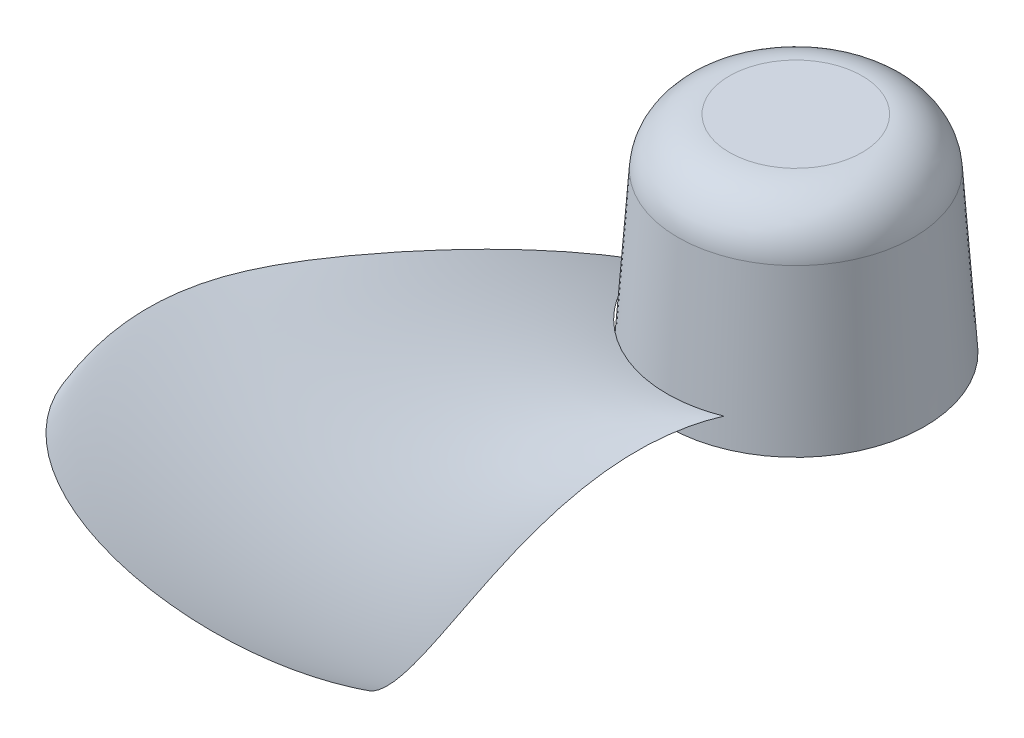
ISO-10303-21;
HEADER;
FILE_DESCRIPTION(('STEP AP214'),'2;1');
FILE_NAME('part.step','',(''),(''),'','','');
FILE_SCHEMA(('AUTOMOTIVE_DESIGN { 1 0 10303 214 1 1 1 1 }'));
ENDSEC;
DATA;
#1=APPLICATION_CONTEXT('core data for automotive mechanical design processes');
#2=APPLICATION_PROTOCOL_DEFINITION('international standard','automotive_design',2000,#1);
#3=PRODUCT_CONTEXT('',#1,'mechanical');
#4=PRODUCT('Part','Part','',(#3));
#5=PRODUCT_RELATED_PRODUCT_CATEGORY('part','',(#4));
#6=PRODUCT_DEFINITION_FORMATION('','',#4);
#7=PRODUCT_DEFINITION_CONTEXT('part definition',#1,'design');
#8=PRODUCT_DEFINITION('design','',#6,#7);
#9=PRODUCT_DEFINITION_SHAPE('','',#8);
#10=(LENGTH_UNIT() NAMED_UNIT(*) SI_UNIT(.MILLI.,.METRE.));
#11=(NAMED_UNIT(*) PLANE_ANGLE_UNIT() SI_UNIT($,.RADIAN.));
#12=(NAMED_UNIT(*) SI_UNIT($,.STERADIAN.) SOLID_ANGLE_UNIT());
#13=UNCERTAINTY_MEASURE_WITH_UNIT(LENGTH_MEASURE(1.E-05),#10,'distance_accuracy_value','');
#14=(GEOMETRIC_REPRESENTATION_CONTEXT(3) GLOBAL_UNCERTAINTY_ASSIGNED_CONTEXT((#13)) GLOBAL_UNIT_ASSIGNED_CONTEXT((#10,
#11,#12)) REPRESENTATION_CONTEXT('',''));
#15=CARTESIAN_POINT('',(0.,0.,0.));
#16=DIRECTION('',(0.,0.,1.));
#17=DIRECTION('',(1.,0.,0.));
#18=AXIS2_PLACEMENT_3D('',#15,#16,#17);
#19=CARTESIAN_POINT('',(-82.3339801079356,49.2189138139021,202.276709230073));
#20=CARTESIAN_POINT('',(-75.4971729120213,49.5652400510354,219.145027979575));
#21=CARTESIAN_POINT('',(-56.4769691664351,45.4608739233665,234.576873252754));
#22=CARTESIAN_POINT('',(-24.8536840963013,34.5970590210232,238.031380508595));
#23=CARTESIAN_POINT('',(7.18928574870839,21.4244877088076,230.945023223419));
#24=CARTESIAN_POINT('',(27.4685438189222,10.393852351522,214.754274873548));
#25=CARTESIAN_POINT('',(35.5644053394643,3.81390935903859,200.));
#26=CARTESIAN_POINT('',(-83.7414580789727,49.4749298561485,198.203067219453));
#27=CARTESIAN_POINT('',(-76.8274734725655,49.5213961036238,215.034421746334));
#28=CARTESIAN_POINT('',(-57.7864973817833,45.063570314038,230.587807898235));
#29=CARTESIAN_POINT('',(-26.1310399964921,33.8407951693911,234.443395282196));
#30=CARTESIAN_POINT('',(5.9944721920043,20.3573627067444,227.86961821542));
#31=CARTESIAN_POINT('',(26.4335057144552,9.11756496315893,212.157051141519));
#32=CARTESIAN_POINT('',(34.7334407745848,2.38205925663447,197.744592569006));
#33=CARTESIAN_POINT('',(-86.3743960144927,49.8297136167028,189.953410418889));
#34=CARTESIAN_POINT('',(-79.3347386509366,49.34227816669,206.697713101452));
#35=CARTESIAN_POINT('',(-60.2952409655178,44.2762604760124,222.474495912178));
#36=CARTESIAN_POINT('',(-28.6328030775855,32.4672014104149,227.105996754223));
#37=CARTESIAN_POINT('',(3.60042967021031,18.4936832105622,221.531133326088));
#38=CARTESIAN_POINT('',(24.3159910013801,6.93428811711902,206.755243705507));
#39=CARTESIAN_POINT('',(32.9953910768478,-0.0465247356594577,193.013294335989));
#40=CARTESIAN_POINT('',(-88.889625070759,49.8914685953709,179.483984585285));
#41=CARTESIAN_POINT('',(-81.7931735263499,48.8875698100463,196.081050277662));
#42=CARTESIAN_POINT('',(-62.9059689960096,43.2876829228264,212.07944563474));
#43=CARTESIAN_POINT('',(-31.4353990109419,31.047596529137,217.603993929814));
#44=CARTESIAN_POINT('',(0.731890904812313,16.7632987308732,213.200928180407));
#45=CARTESIAN_POINT('',(21.6426668485063,5.03077762993028,199.538252099295));
#46=CARTESIAN_POINT('',(30.6961014275635,-2.10575536911751,186.596017048733));
#47=CARTESIAN_POINT('',(-90.3170676782875,49.7219040223135,171.053554263032));
#48=CARTESIAN_POINT('',(-83.2443622134239,48.3868449537963,187.508589176232));
#49=CARTESIAN_POINT('',(-64.5827643434887,42.4828782869279,203.647912789845));
#50=CARTESIAN_POINT('',(-33.4040515291689,30.0619908008786,209.838416673284));
#51=CARTESIAN_POINT('',(-1.42787872750411,15.6930900939997,206.324306692801));
#52=CARTESIAN_POINT('',(19.5352967698671,3.94508376464222,193.515839662719));
#53=CARTESIAN_POINT('',(28.8187775275678,-3.23401496636415,181.189134880292));
#54=CARTESIAN_POINT('',(-91.0809594173836,49.4865976445128,164.674739028568));
#55=CARTESIAN_POINT('',(-84.0611857591692,47.9421685554468,181.015103125516));
#56=CARTESIAN_POINT('',(-65.6214762550227,41.8686423416105,197.247901333732));
#57=CARTESIAN_POINT('',(-34.7319008127437,29.3901544199827,203.92157644471));
#58=CARTESIAN_POINT('',(-2.96931034062587,15.0358019153338,201.057887827185));
#59=CARTESIAN_POINT('',(17.9804814515183,3.33468195243393,188.877855987575));
#60=CARTESIAN_POINT('',(27.4013745962118,-3.8373408856957,177.004651174382));
#61=CARTESIAN_POINT('',(-91.5176556764111,49.1443081265234,158.261284030915));
#62=CARTESIAN_POINT('',(-84.5871548695684,47.4275265994236,174.477257953096));
#63=CARTESIAN_POINT('',(-66.4238452982944,41.239967212392,190.788951718138));
#64=CARTESIAN_POINT('',(-35.8960893175013,28.7779140202159,197.926359339621));
#65=CARTESIAN_POINT('',(-4.41976326437563,14.5121448828272,195.69365336802));
#66=CARTESIAN_POINT('',(16.4621332554577,2.91343766015755,184.127477681108));
#67=CARTESIAN_POINT('',(25.9840977424213,-4.21449170258027,172.698053478632));
#68=CARTESIAN_POINT('',(-91.6107462476351,48.6932294882373,151.777724178798));
#69=CARTESIAN_POINT('',(-84.8066231284212,46.839458917169,167.864330032252));
#70=CARTESIAN_POINT('',(-66.9753707444052,40.59091144804,184.24745251318));
#71=CARTESIAN_POINT('',(-36.883643897612,28.2160197734461,191.838636857249));
#72=CARTESIAN_POINT('',(-5.76779193599245,14.109560791448,190.226957743653));
#73=CARTESIAN_POINT('',(14.9905520571445,2.66631140010644,179.267171368499));
#74=CARTESIAN_POINT('',(24.5764830501213,-4.38216109317431,168.27654988278));
#75=CARTESIAN_POINT('',(-91.356710792262,48.1407901574141,145.31042483203));
#76=CARTESIAN_POINT('',(-84.715401780808,46.1827137026742,161.253889470567));
#77=CARTESIAN_POINT('',(-67.2708612142471,39.922202891893,177.687780948096));
#78=CARTESIAN_POINT('',(-37.6880363417165,27.6998390554747,185.70519572237));
#79=CARTESIAN_POINT('',(-7.00553131186566,13.8180565494608,184.686997174399));
#80=CARTESIAN_POINT('',(13.5746055243779,2.57928972989261,174.312940391716));
#81=CARTESIAN_POINT('',(23.1880666032366,-4.35704273363429,163.747348476564));
#82=CARTESIAN_POINT('',(-90.7575171674185,47.4966023600821,138.931474067234));
#83=CARTESIAN_POINT('',(-84.3141804681835,45.4639803039468,154.710815457231));
#84=CARTESIAN_POINT('',(-67.3090890257659,39.2361465749277,171.164002880929));
#85=CARTESIAN_POINT('',(-38.3054825364157,27.2258311412378,179.565684018165));
#86=CARTESIAN_POINT('',(-8.12664084725145,13.6282456757606,179.099001968575));
#87=CARTESIAN_POINT('',(12.2225515254104,2.63860185138012,169.279201727931));
#88=CARTESIAN_POINT('',(21.828384485692,-4.15583030011666,159.117657349725));
#89=CARTESIAN_POINT('',(-89.8313134154085,46.7632572755808,132.616239224137));
#90=CARTESIAN_POINT('',(-83.6180312188259,44.6837071386046,148.214013193085));
#91=CARTESIAN_POINT('',(-67.100512186202,38.5299767721795,164.660330304188));
#92=CARTESIAN_POINT('',(-38.7402884608991,26.7869447823268,173.411389459367));
#93=CARTESIAN_POINT('',(-9.12927449328848,13.5287913984954,173.461335563138));
#94=CARTESIAN_POINT('',(10.9408501301414,2.8296968501343,164.16962560577));
#95=CARTESIAN_POINT('',(20.5069727814124,-3.79521746877788,154.394684592));
#96=CARTESIAN_POINT('',(-88.1700723202821,45.6750190229614,124.30429921228));
#97=CARTESIAN_POINT('',(-82.3038139897761,43.5663114932533,139.635190193852));
#98=CARTESIAN_POINT('',(-66.4968182973537,37.5615056828707,156.035157249194));
#99=CARTESIAN_POINT('',(-39.0750073158606,26.2416783815797,165.202467576341));
#100=CARTESIAN_POINT('',(-10.3016660354014,13.5029278700546,165.891665032639));
#101=CARTESIAN_POINT('',(9.3359414619092,3.24135242897011,157.266885814004));
#102=CARTESIAN_POINT('',(18.8088325052928,-3.12412473143991,147.98262286017));
#103=CARTESIAN_POINT('',(-85.3620257124336,44.1076295704552,114.055216395623));
#104=CARTESIAN_POINT('',(-79.9948959685405,42.0204891054436,129.01494744001));
#105=CARTESIAN_POINT('',(-65.1740775823955,36.2888596985314,145.300642621203));
#106=CARTESIAN_POINT('',(-39.0559800386989,25.6140658691651,154.913154507379));
#107=CARTESIAN_POINT('',(-11.460427125213,13.6405965592458,156.326303748406));
#108=CARTESIAN_POINT('',(7.53851083342287,4.01294071067409,148.478853648741));
#109=CARTESIAN_POINT('',(16.8295136129302,-1.97022619599685,139.770382066863));
#110=CARTESIAN_POINT('',(-81.3726907344826,41.9046403631168,101.934045803019));
#111=CARTESIAN_POINT('',(-76.6394064114887,39.9203386687536,116.399993158882));
#112=CARTESIAN_POINT('',(-63.0543374683225,34.6319583855243,132.475974445245));
#113=CARTESIAN_POINT('',(-38.5704782839094,24.8851213084929,142.525944674457));
#114=CARTESIAN_POINT('',(-12.4580536447195,13.9839060265253,144.711052529355));
#115=CARTESIAN_POINT('',(5.72214419206094,5.23239112848768,137.723809726602));
#116=CARTESIAN_POINT('',(14.7599899379527,-0.215045180683903,129.65789602717));
#117=CARTESIAN_POINT('',(-77.1740781236625,39.3867832276097,89.9982940050828));
#118=CARTESIAN_POINT('',(-73.0554536621915,37.5666337807501,103.927618654147));
#119=CARTESIAN_POINT('',(-60.6773558229395,32.813472836487,119.729627518267));
#120=CARTESIAN_POINT('',(-37.7893638790571,24.117219465501,130.131378053961));
#121=CARTESIAN_POINT('',(-13.1216963954103,14.410885165196,133.002766486181));
#122=CARTESIAN_POINT('',(4.26853965857924,6.62748143297552,126.811472452925));
#123=CARTESIAN_POINT('',(13.0724139302319,1.77708919815868,119.345277617664));
#124=CARTESIAN_POINT('',(-72.9409370212097,36.5416471645396,78.1784223700364));
#125=CARTESIAN_POINT('',(-69.3898937715923,34.9335036187217,91.5424189995471));
#126=CARTESIAN_POINT('',(-58.1481490617507,30.7873424937314,107.027397472291));
#127=CARTESIAN_POINT('',(-36.7618670590607,23.2373801358667,117.723517688958));
#128=CARTESIAN_POINT('',(-13.4447994316185,14.8216341243,121.223776072989));
#129=CARTESIAN_POINT('',(3.22609281408386,8.07812203820346,115.785372840099));
#130=CARTESIAN_POINT('',(11.8430742611667,3.87262753127923,108.890191556253));
#131=CARTESIAN_POINT('',(-68.7391178100251,33.3488078744686,66.4607037895824));
#132=CARTESIAN_POINT('',(-65.6927838943367,31.9879544265841,79.2385995119185));
#133=CARTESIAN_POINT('',(-55.4930844970184,28.5017194162047,94.3753882618553));
#134=CARTESIAN_POINT('',(-35.4827686796712,22.1686164652451,105.324332384254));
#135=CARTESIAN_POINT('',(-13.3905571525843,15.1140271362005,109.411914944854));
#136=CARTESIAN_POINT('',(2.65529910171813,9.46333299156579,104.6952431809));
#137=CARTESIAN_POINT('',(11.1482596021558,5.9380204094261,98.350302560848));
#138=CARTESIAN_POINT('',(-64.6139209908258,29.7903782667061,54.8343412167721));
#139=CARTESIAN_POINT('',(-61.9959146231287,28.6992477449181,67.0129700070748));
#140=CARTESIAN_POINT('',(-52.7236878594273,25.9065880913937,81.7818199969167));
#141=CARTESIAN_POINT('',(-33.9365746555477,20.8352102036651,92.9572559753292));
#142=CARTESIAN_POINT('',(-12.9164556569408,15.1866432134684,97.6058306627816));
#143=CARTESIAN_POINT('',(2.61893728486805,10.6624162525399,93.5911413304739));
#144=CARTESIAN_POINT('',(11.0642586245981,7.83971842334764,87.7832753493581));
#145=CARTESIAN_POINT('',(-60.5795386678411,25.8350938146211,43.3049417433776));
#146=CARTESIAN_POINT('',(-58.3034246426835,25.0247540601344,54.8769217574702));
#147=CARTESIAN_POINT('',(-49.8290177044212,22.9422715252729,69.2667602209519));
#148=CARTESIAN_POINT('',(-32.0922367031054,19.1547543831853,80.653924367025));
#149=CARTESIAN_POINT('',(-11.9713398220748,14.9343454142466,85.8487274929759));
#150=CARTESIAN_POINT('',(3.18324261541826,11.5531873988319,82.5249478260497));
#151=CARTESIAN_POINT('',(11.6673599998927,9.44417216379218,77.2467746396931));
#152=CARTESIAN_POINT('',(-56.6413409321908,21.441532993012,31.8837679338026));
#153=CARTESIAN_POINT('',(-54.6116108482853,20.9128154154708,42.8468731223423));
#154=CARTESIAN_POINT('',(-46.7917611335312,19.5417571137378,56.8543609854497));
#155=CARTESIAN_POINT('',(-29.9142955322048,17.0397635365791,68.4488012004977));
#156=CARTESIAN_POINT('',(-10.5016039661759,14.2491754081864,74.1853806662617));
#157=CARTESIAN_POINT('',(4.41543056893223,12.0123334527514,71.5491715907029));
#158=CARTESIAN_POINT('',(13.0338523994382,10.6178322215081,66.7984651497626));
#159=CARTESIAN_POINT('',(-52.8061594922932,16.5647376120425,20.5831823380751));
#160=CARTESIAN_POINT('',(-50.9180693505952,16.3086301522667,30.9402202259283));
#161=CARTESIAN_POINT('',(-43.5956608607822,15.6354779948924,44.5695687759608));
#162=CARTESIAN_POINT('',(-27.3680226613557,14.4009838643026,56.3769001097163));
#163=CARTESIAN_POINT('',(-8.45404841223906,13.0221924580959,62.6608709650259));
#164=CARTESIAN_POINT('',(6.38255421905134,11.9161484738705,60.7164437681339));
#165=CARTESIAN_POINT('',(15.2400244946336,11.2271491872437,56.4960115974763));
#166=CARTESIAN_POINT('',(-50.3205711184605,12.9286428545703,13.1491721155176));
#167=CARTESIAN_POINT('',(-48.4511470681454,12.8453461587867,23.1061614617028));
#168=CARTESIAN_POINT('',(-41.3467252564934,12.6240707925412,36.4894116245368));
#169=CARTESIAN_POINT('',(-25.4007842514895,12.2167176639613,48.4466630216771));
#170=CARTESIAN_POINT('',(-6.66776714013701,11.7612654435092,55.10355412093));
#171=CARTESIAN_POINT('',(8.22885502707457,11.3956928016466,53.626309331334));
#172=CARTESIAN_POINT('',(17.3214514694631,11.1680988302461,49.7633896663214));
#173=CARTESIAN_POINT('',(-49.0966619887611,11.,9.46138370225729));
#174=CARTESIAN_POINT('',(-47.2160975141052,11.,19.2199392440039));
#175=CARTESIAN_POINT('',(-40.1899588364851,11.,32.4825259128318));
#176=CARTESIAN_POINT('',(-24.3439194886276,11.,44.5179182744553));
#177=CARTESIAN_POINT('',(-5.66043400609239,11.,51.3644504284708));
#178=CARTESIAN_POINT('',(9.29690813412839,11.,50.1231825421159));
#179=CARTESIAN_POINT('',(18.5275411299524,11.,46.4406095963211));
#180=B_SPLINE_SURFACE_WITH_KNOTS('',3,3,((#19,#20,#21,#22,#23,#24,#25),(#26,#27,#28,#29,#30,#31,
#32),(#33,#34,#35,#36,#37,#38,#39),(#40,#41,#42,#43,#44,#45,#46),(#47,#48,#49,#50,#51,#52,#53),
(#54,#55,#56,#57,#58,#59,#60),(#61,#62,#63,#64,#65,#66,#67),(#68,#69,#70,#71,#72,#73,#74),(#75,
#76,#77,#78,#79,#80,#81),(#82,#83,#84,#85,#86,#87,#88),(#89,#90,#91,#92,#93,#94,#95),(#96,#97,
#98,#99,#100,#101,#102),(#103,#104,#105,#106,#107,#108,#109),(#110,#111,#112,#113,#114,#115,
#116),(#117,#118,#119,#120,#121,#122,#123),(#124,#125,#126,#127,#128,#129,#130),(#131,#132,#133,
#134,#135,#136,#137),(#138,#139,#140,#141,#142,#143,#144),(#145,#146,#147,#148,#149,#150,#151),
(#152,#153,#154,#155,#156,#157,#158),(#159,#160,#161,#162,#163,#164,#165),(#166,#167,#168,#169,
#170,#171,#172),(#173,#174,#175,#176,#177,#178,#179)),.UNSPECIFIED.,.F.,.F.,.F.,(4,1,1,1,1,1,1,
1,1,1,1,1,1,1,1,1,1,1,1,1,4),(4,1,1,1,4),(0.,0.0625,0.125,0.15625,0.1875,0.21875,0.25,0.28125,
0.3125,0.34375,0.375,0.4375,0.5,0.5625,0.625,0.6875,0.75,0.8125,0.875,0.9375,1.),(0.,
0.333333333333333,0.5,0.666666666666667,1.),.UNSPECIFIED.);
#181=CARTESIAN_POINT('',(-82.3339801079356,49.2189138139021,202.276709230073));
#182=CARTESIAN_POINT('',(-83.7414580789727,49.4749298561485,198.203067219453));
#183=CARTESIAN_POINT('',(-86.3743960144927,49.8297136167028,189.953410418889));
#184=CARTESIAN_POINT('',(-88.889625070759,49.8914685953709,179.483984585285));
#185=CARTESIAN_POINT('',(-90.3170676782875,49.7219040223135,171.053554263032));
#186=CARTESIAN_POINT('',(-91.0809594173836,49.4865976445128,164.674739028568));
#187=CARTESIAN_POINT('',(-91.5176556764111,49.1443081265234,158.261284030915));
#188=CARTESIAN_POINT('',(-91.6107462476351,48.6932294882373,151.777724178798));
#189=CARTESIAN_POINT('',(-91.356710792262,48.1407901574141,145.31042483203));
#190=CARTESIAN_POINT('',(-90.7575171674185,47.4966023600821,138.931474067234));
#191=CARTESIAN_POINT('',(-89.8313134154085,46.7632572755808,132.616239224137));
#192=CARTESIAN_POINT('',(-88.1700723202821,45.6750190229614,124.30429921228));
#193=CARTESIAN_POINT('',(-85.3620257124336,44.1076295704552,114.055216395623));
#194=CARTESIAN_POINT('',(-81.3726907344826,41.9046403631168,101.934045803019));
#195=CARTESIAN_POINT('',(-77.1740781236625,39.3867832276097,89.9982940050828));
#196=CARTESIAN_POINT('',(-72.9409370212097,36.5416471645396,78.1784223700364));
#197=CARTESIAN_POINT('',(-68.7391178100251,33.3488078744686,66.4607037895824));
#198=CARTESIAN_POINT('',(-64.6139209908258,29.7903782667061,54.8343412167721));
#199=CARTESIAN_POINT('',(-60.5795386678411,25.8350938146211,43.3049417433776));
#200=CARTESIAN_POINT('',(-56.6413409321908,21.441532993012,31.8837679338026));
#201=CARTESIAN_POINT('',(-52.8061594922932,16.5647376120425,20.5831823380751));
#202=CARTESIAN_POINT('',(-50.3205711184605,12.9286428545703,13.1491721155176));
#203=CARTESIAN_POINT('',(-49.0966619887611,11.,9.46138370225729));
#204=B_SPLINE_CURVE_WITH_KNOTS('',3,(#181,#182,#183,#184,#185,#186,#187,#188,#189,#190,#191,
#192,#193,#194,#195,#196,#197,#198,#199,#200,#201,#202,#203),.UNSPECIFIED.,.F.,.F.,(4,1,1,1,1,1,
1,1,1,1,1,1,1,1,1,1,1,1,1,1,4),(0.,0.0625,0.125,0.15625,0.1875,0.21875,0.25,0.28125,0.3125,
0.34375,0.375,0.4375,0.5,0.5625,0.625,0.6875,0.75,0.8125,0.875,0.9375,1.),.UNSPECIFIED.);
#205=CARTESIAN_POINT('',(-82.3339801079356,49.2189138139021,202.276709230073));
#206=VERTEX_POINT('',#205);
#207=CARTESIAN_POINT('',(-49.0966619887611,11.,9.46138370225729));
#208=VERTEX_POINT('',#207);
#209=EDGE_CURVE('E14',#206,#208,#204,.T.);
#210=CARTESIAN_POINT('',(-49.0966619887611,11.,9.46138370225729));
#211=CARTESIAN_POINT('',(-47.2160975141052,11.,19.2199392440039));
#212=CARTESIAN_POINT('',(-40.1899588364851,11.,32.4825259128318));
#213=CARTESIAN_POINT('',(-24.3439194886276,11.,44.5179182744553));
#214=CARTESIAN_POINT('',(-5.66043400609239,11.,51.3644504284708));
#215=CARTESIAN_POINT('',(9.29690813412839,11.,50.1231825421159));
#216=CARTESIAN_POINT('',(18.5275411299524,11.,46.4406095963211));
#217=B_SPLINE_CURVE_WITH_KNOTS('',3,(#210,#211,#212,#213,#214,#215,#216),.UNSPECIFIED.,.F.,.F.,
(4,1,1,1,4),(0.,0.333333333333333,0.5,0.666666666666667,1.),.UNSPECIFIED.);
#218=CARTESIAN_POINT('',(18.5275411299524,11.,46.4406095963211));
#219=VERTEX_POINT('',#218);
#220=EDGE_CURVE('E73',#208,#219,#217,.T.);
#221=CARTESIAN_POINT('',(35.5644053394643,3.81390935903859,200.));
#222=CARTESIAN_POINT('',(34.7334407745848,2.38205925663447,197.744592569006));
#223=CARTESIAN_POINT('',(32.9953910768478,-0.0465247356594577,193.013294335989));
#224=CARTESIAN_POINT('',(30.6961014275635,-2.10575536911751,186.596017048733));
#225=CARTESIAN_POINT('',(28.8187775275678,-3.23401496636415,181.189134880292));
#226=CARTESIAN_POINT('',(27.4013745962118,-3.8373408856957,177.004651174382));
#227=CARTESIAN_POINT('',(25.9840977424213,-4.21449170258027,172.698053478632));
#228=CARTESIAN_POINT('',(24.5764830501213,-4.38216109317431,168.27654988278));
#229=CARTESIAN_POINT('',(23.1880666032366,-4.35704273363429,163.747348476564));
#230=CARTESIAN_POINT('',(21.828384485692,-4.15583030011666,159.117657349725));
#231=CARTESIAN_POINT('',(20.5069727814124,-3.79521746877788,154.394684592));
#232=CARTESIAN_POINT('',(18.8088325052928,-3.12412473143991,147.98262286017));
#233=CARTESIAN_POINT('',(16.8295136129302,-1.97022619599685,139.770382066863));
#234=CARTESIAN_POINT('',(14.7599899379527,-0.215045180683903,129.65789602717));
#235=CARTESIAN_POINT('',(13.0724139302319,1.77708919815868,119.345277617664));
#236=CARTESIAN_POINT('',(11.8430742611667,3.87262753127923,108.890191556253));
#237=CARTESIAN_POINT('',(11.1482596021558,5.9380204094261,98.350302560848));
#238=CARTESIAN_POINT('',(11.0642586245981,7.83971842334764,87.7832753493581));
#239=CARTESIAN_POINT('',(11.6673599998927,9.44417216379218,77.2467746396931));
#240=CARTESIAN_POINT('',(13.0338523994382,10.6178322215081,66.7984651497626));
#241=CARTESIAN_POINT('',(15.2400244946336,11.2271491872437,56.4960115974763));
#242=CARTESIAN_POINT('',(17.3214514694631,11.1680988302461,49.7633896663214));
#243=CARTESIAN_POINT('',(18.5275411299524,11.,46.4406095963211));
#244=B_SPLINE_CURVE_WITH_KNOTS('',3,(#221,#222,#223,#224,#225,#226,#227,#228,#229,#230,#231,
#232,#233,#234,#235,#236,#237,#238,#239,#240,#241,#242,#243),.UNSPECIFIED.,.F.,.F.,(4,1,1,1,1,1,
1,1,1,1,1,1,1,1,1,1,1,1,1,1,4),(0.,0.0625,0.125,0.15625,0.1875,0.21875,0.25,0.28125,0.3125,
0.34375,0.375,0.4375,0.5,0.5625,0.625,0.6875,0.75,0.8125,0.875,0.9375,1.),.UNSPECIFIED.);
#245=CARTESIAN_POINT('',(35.5644053394643,3.81390935903859,200.));
#246=VERTEX_POINT('',#245);
#247=EDGE_CURVE('E81',#219,#246,#244,.F.);
#248=CARTESIAN_POINT('',(-82.3339801079356,49.2189138139021,202.276709230073));
#249=CARTESIAN_POINT('',(-75.4971729120213,49.5652400510354,219.145027979575));
#250=CARTESIAN_POINT('',(-56.4769691664351,45.4608739233665,234.576873252754));
#251=CARTESIAN_POINT('',(-24.8536840963013,34.5970590210232,238.031380508595));
#252=CARTESIAN_POINT('',(7.18928574870839,21.4244877088076,230.945023223419));
#253=CARTESIAN_POINT('',(27.4685438189222,10.393852351522,214.754274873548));
#254=CARTESIAN_POINT('',(35.5644053394643,3.81390935903859,200.));
#255=B_SPLINE_CURVE_WITH_KNOTS('',3,(#248,#249,#250,#251,#252,#253,#254),.UNSPECIFIED.,.F.,.F.,
(4,1,1,1,4),(0.,0.333333333333333,0.5,0.666666666666667,1.),.UNSPECIFIED.);
#256=EDGE_CURVE('E65',#246,#206,#255,.F.);
#257=ORIENTED_EDGE('',*,*,#209,.T.);
#258=ORIENTED_EDGE('',*,*,#220,.T.);
#259=ORIENTED_EDGE('',*,*,#247,.T.);
#260=ORIENTED_EDGE('',*,*,#256,.T.);
#261=EDGE_LOOP('',(#257,#258,#259,#260));
#262=FACE_BOUND('',#261,.T.);
#263=ADVANCED_FACE('F62',(#262),#180,.T.);
#264=OPEN_SHELL('',(#263));
#265=SHELL_BASED_SURFACE_MODEL('B2',(#264));
#266=CARTESIAN_POINT('',(0.,0.,0.));
#267=DIRECTION('',(0.,-1.,0.));
#268=DIRECTION('',(0.,0.,1.));
#269=AXIS2_PLACEMENT_3D('',#266,#267,#268);
#270=CONICAL_SURFACE('',#269,50.,0.0698131700797733);
#271=CARTESIAN_POINT('',(0.,61.3951294748825,0.));
#272=DIRECTION('',(0.,-1.,0.));
#273=DIRECTION('',(0.,0.,-1.));
#274=AXIS2_PLACEMENT_3D('',#271,#272,#273);
#275=CIRCLE('',#274,45.7068343269624);
#276=CARTESIAN_POINT('',(0.,61.3951294748825,-45.7068343269624));
#277=VERTEX_POINT('',#276);
#278=EDGE_CURVE('E61',#277,#277,#275,.T.);
#279=ORIENTED_EDGE('',*,*,#278,.T.);
#280=EDGE_LOOP('',(#279));
#281=FACE_BOUND('',#280,.T.);
#282=CARTESIAN_POINT('',(0.,0.,0.));
#283=DIRECTION('',(0.,1.,0.));
#284=DIRECTION('',(0.,0.,1.));
#285=AXIS2_PLACEMENT_3D('',#282,#283,#284);
#286=CIRCLE('',#285,50.);
#287=CARTESIAN_POINT('',(0.,0.,50.));
#288=VERTEX_POINT('',#287);
#289=EDGE_CURVE('E143',#288,#288,#286,.T.);
#290=ORIENTED_EDGE('',*,*,#289,.T.);
#291=EDGE_LOOP('',(#290));
#292=FACE_BOUND('',#291,.T.);
#293=ADVANCED_FACE('F132',(#281,#292),#270,.T.);
#294=CARTESIAN_POINT('',(0.,80.,0.));
#295=DIRECTION('',(0.,1.,0.));
#296=DIRECTION('',(0.,0.,1.));
#297=AXIS2_PLACEMENT_3D('',#294,#295,#296);
#298=PLANE('',#297);
#299=CARTESIAN_POINT('',(0.,80.,0.));
#300=DIRECTION('',(0.,1.,0.));
#301=DIRECTION('',(0.,0.,1.));
#302=AXIS2_PLACEMENT_3D('',#299,#300,#301);
#303=CIRCLE('',#302,25.7555533217659);
#304=CARTESIAN_POINT('',(0.,80.,25.7555533217659));
#305=VERTEX_POINT('',#304);
#306=EDGE_CURVE('E139',#305,#305,#303,.T.);
#307=ORIENTED_EDGE('',*,*,#306,.T.);
#308=EDGE_LOOP('',(#307));
#309=FACE_BOUND('',#308,.T.);
#310=ADVANCED_FACE('F153',(#309),#298,.T.);
#311=CARTESIAN_POINT('',(0.,0.,0.));
#312=DIRECTION('',(0.,1.,0.));
#313=DIRECTION('',(0.,0.,1.));
#314=AXIS2_PLACEMENT_3D('',#311,#312,#313);
#315=PLANE('',#314);
#316=ORIENTED_EDGE('',*,*,#289,.F.);
#317=EDGE_LOOP('',(#316));
#318=FACE_BOUND('',#317,.T.);
#319=ADVANCED_FACE('F151',(#318),#315,.F.);
#320=CARTESIAN_POINT('',(0.,60.,0.));
#321=DIRECTION('',(0.,1.,0.));
#322=DIRECTION('',(0.,0.,1.));
#323=AXIS2_PLACEMENT_3D('',#320,#321,#322);
#324=TOROIDAL_SURFACE('',#323,25.7555533217659,20.);
#325=ORIENTED_EDGE('',*,*,#278,.F.);
#326=EDGE_LOOP('',(#325));
#327=FACE_BOUND('',#326,.T.);
#328=ORIENTED_EDGE('',*,*,#306,.F.);
#329=EDGE_LOOP('',(#328));
#330=FACE_BOUND('',#329,.T.);
#331=ADVANCED_FACE('F134',(#327,#330),#324,.T.);
#332=CLOSED_SHELL('',(#293,#310,#319,#331));
#333=MANIFOLD_SOLID_BREP('B8',#332);
#334=ADVANCED_BREP_SHAPE_REPRESENTATION('',(#18,#333),#14);
#335=MANIFOLD_SURFACE_SHAPE_REPRESENTATION('',(#18,#265),#14);
#336=SHAPE_REPRESENTATION('',(#18),#14);
#337=SHAPE_DEFINITION_REPRESENTATION(#9,#336);
#338=SHAPE_REPRESENTATION_RELATIONSHIP('','',#336,#334);
#339=SHAPE_REPRESENTATION_RELATIONSHIP('','',#336,#335);
ENDSEC;
END-ISO-10303-21;
